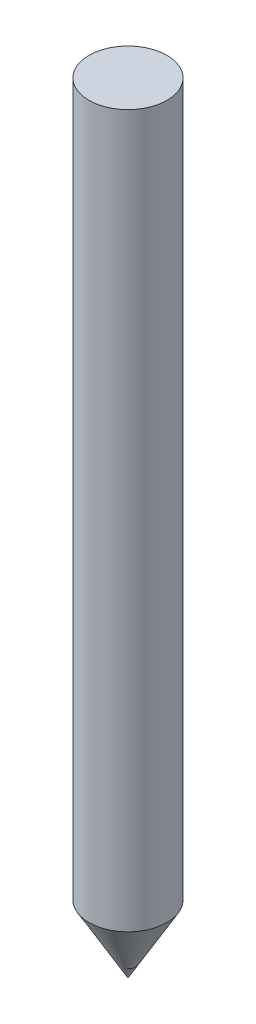
ISO-10303-21;
HEADER;
FILE_DESCRIPTION(('STEP AP214'),'2;1');
FILE_NAME('part.step','',(''),(''),'','','');
FILE_SCHEMA(('AUTOMOTIVE_DESIGN { 1 0 10303 214 1 1 1 1 }'));
ENDSEC;
DATA;
#1=APPLICATION_CONTEXT('core data for automotive mechanical design processes');
#2=APPLICATION_PROTOCOL_DEFINITION('international standard','automotive_design',2000,#1);
#3=PRODUCT_CONTEXT('',#1,'mechanical');
#4=PRODUCT('Part','Part','',(#3));
#5=PRODUCT_RELATED_PRODUCT_CATEGORY('part','',(#4));
#6=PRODUCT_DEFINITION_FORMATION('','',#4);
#7=PRODUCT_DEFINITION_CONTEXT('part definition',#1,'design');
#8=PRODUCT_DEFINITION('design','',#6,#7);
#9=PRODUCT_DEFINITION_SHAPE('','',#8);
#10=(LENGTH_UNIT() NAMED_UNIT(*) SI_UNIT(.MILLI.,.METRE.));
#11=(NAMED_UNIT(*) PLANE_ANGLE_UNIT() SI_UNIT($,.RADIAN.));
#12=(NAMED_UNIT(*) SI_UNIT($,.STERADIAN.) SOLID_ANGLE_UNIT());
#13=UNCERTAINTY_MEASURE_WITH_UNIT(LENGTH_MEASURE(1.E-05),#10,'distance_accuracy_value','');
#14=(GEOMETRIC_REPRESENTATION_CONTEXT(3) GLOBAL_UNCERTAINTY_ASSIGNED_CONTEXT((#13)) GLOBAL_UNIT_ASSIGNED_CONTEXT((#10,
#11,#12)) REPRESENTATION_CONTEXT('',''));
#15=CARTESIAN_POINT('',(0.,0.,0.));
#16=DIRECTION('',(0.,0.,1.));
#17=DIRECTION('',(1.,0.,0.));
#18=AXIS2_PLACEMENT_3D('',#15,#16,#17);
#19=CARTESIAN_POINT('',(0.,120.,0.));
#20=DIRECTION('',(0.,-1.,0.));
#21=DIRECTION('',(0.,0.,-1.));
#22=AXIS2_PLACEMENT_3D('',#19,#20,#21);
#23=CYLINDRICAL_SURFACE('',#22,6.);
#24=CARTESIAN_POINT('',(0.,10.3923048454133,0.));
#25=DIRECTION('',(0.,1.,0.));
#26=DIRECTION('',(0.,0.,1.));
#27=AXIS2_PLACEMENT_3D('',#24,#25,#26);
#28=CIRCLE('',#27,6.);
#29=CARTESIAN_POINT('',(0.,10.3923048454133,6.));
#30=VERTEX_POINT('',#29);
#31=EDGE_CURVE('E11',#30,#30,#28,.T.);
#32=ORIENTED_EDGE('',*,*,#31,.T.);
#33=EDGE_LOOP('',(#32));
#34=FACE_BOUND('',#33,.T.);
#35=CARTESIAN_POINT('',(0.,120.,0.));
#36=DIRECTION('',(0.,1.,0.));
#37=DIRECTION('',(0.,0.,1.));
#38=AXIS2_PLACEMENT_3D('',#35,#36,#37);
#39=CIRCLE('',#38,6.);
#40=CARTESIAN_POINT('',(0.,120.,6.));
#41=VERTEX_POINT('',#40);
#42=EDGE_CURVE('E40',#41,#41,#39,.T.);
#43=ORIENTED_EDGE('',*,*,#42,.F.);
#44=EDGE_LOOP('',(#43));
#45=FACE_BOUND('',#44,.T.);
#46=ADVANCED_FACE('F33',(#34,#45),#23,.T.);
#47=CARTESIAN_POINT('',(0.,120.,0.));
#48=DIRECTION('',(0.,1.,0.));
#49=DIRECTION('',(0.,0.,1.));
#50=AXIS2_PLACEMENT_3D('',#47,#48,#49);
#51=PLANE('',#50);
#52=ORIENTED_EDGE('',*,*,#42,.T.);
#53=EDGE_LOOP('',(#52));
#54=FACE_BOUND('',#53,.T.);
#55=ADVANCED_FACE('F45',(#54),#51,.T.);
#56=CARTESIAN_POINT('',(0.,10.3923048454133,0.));
#57=DIRECTION('',(0.,1.,0.));
#58=DIRECTION('',(0.,0.,1.));
#59=AXIS2_PLACEMENT_3D('',#56,#57,#58);
#60=CONICAL_SURFACE('',#59,6.00000000000003,0.523598775598301);
#61=CARTESIAN_POINT('',(0.,0.,0.));
#62=VERTEX_POINT('',#61);
#63=VERTEX_LOOP('',#62);
#64=FACE_BOUND('',#63,.T.);
#65=ORIENTED_EDGE('',*,*,#31,.F.);
#66=EDGE_LOOP('',(#65));
#67=FACE_BOUND('',#66,.T.);
#68=ADVANCED_FACE('F35',(#64,#67),#60,.T.);
#69=CLOSED_SHELL('',(#46,#55,#68));
#70=MANIFOLD_SOLID_BREP('B2',#69);
#71=ADVANCED_BREP_SHAPE_REPRESENTATION('',(#18,#70),#14);
#72=SHAPE_DEFINITION_REPRESENTATION(#9,#71);
ENDSEC;
END-ISO-10303-21;
